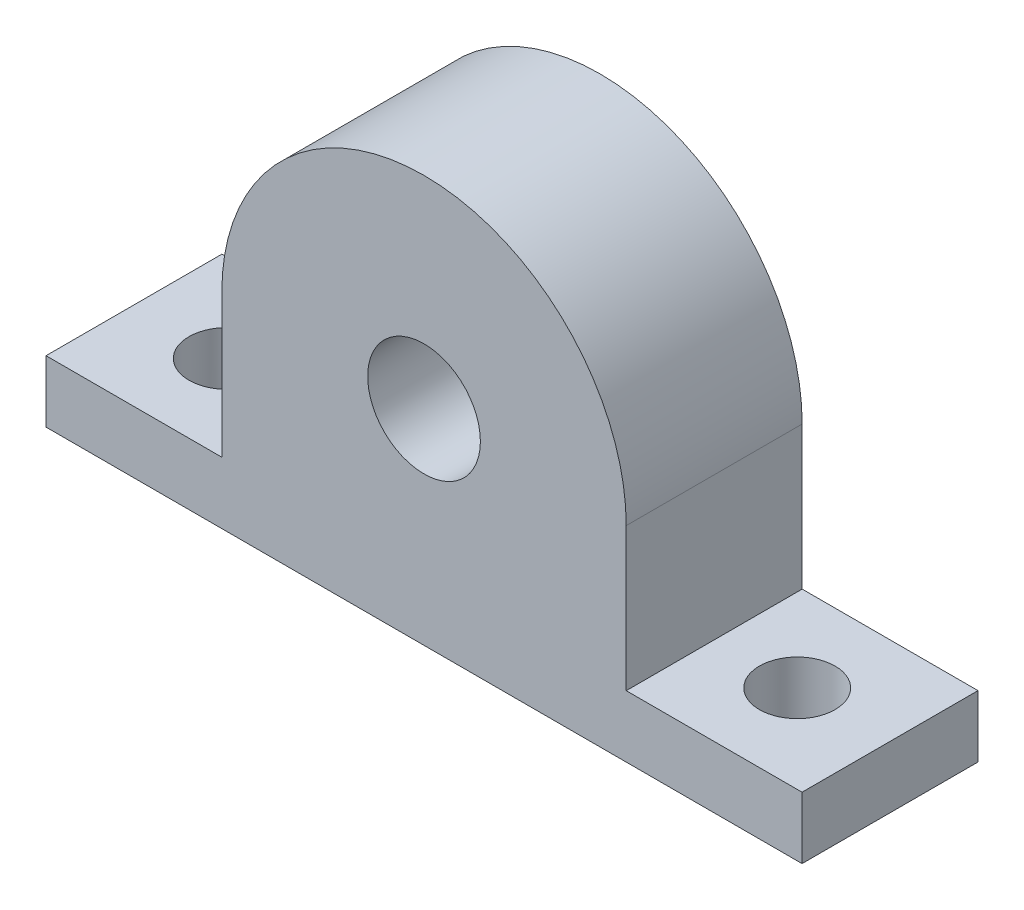
ISO-10303-21;
HEADER;
FILE_DESCRIPTION(('STEP AP214'),'2;1');
FILE_NAME('part.step','',(''),(''),'','','');
FILE_SCHEMA(('AUTOMOTIVE_DESIGN { 1 0 10303 214 1 1 1 1 }'));
ENDSEC;
DATA;
#1=APPLICATION_CONTEXT('core data for automotive mechanical design processes');
#2=APPLICATION_PROTOCOL_DEFINITION('international standard','automotive_design',2000,#1);
#3=PRODUCT_CONTEXT('',#1,'mechanical');
#4=PRODUCT('Part','Part','',(#3));
#5=PRODUCT_RELATED_PRODUCT_CATEGORY('part','',(#4));
#6=PRODUCT_DEFINITION_FORMATION('','',#4);
#7=PRODUCT_DEFINITION_CONTEXT('part definition',#1,'design');
#8=PRODUCT_DEFINITION('design','',#6,#7);
#9=PRODUCT_DEFINITION_SHAPE('','',#8);
#10=(LENGTH_UNIT() NAMED_UNIT(*) SI_UNIT(.MILLI.,.METRE.));
#11=(NAMED_UNIT(*) PLANE_ANGLE_UNIT() SI_UNIT($,.RADIAN.));
#12=(NAMED_UNIT(*) SI_UNIT($,.STERADIAN.) SOLID_ANGLE_UNIT());
#13=UNCERTAINTY_MEASURE_WITH_UNIT(LENGTH_MEASURE(1.E-05),#10,'distance_accuracy_value','');
#14=(GEOMETRIC_REPRESENTATION_CONTEXT(3) GLOBAL_UNCERTAINTY_ASSIGNED_CONTEXT((#13)) GLOBAL_UNIT_ASSIGNED_CONTEXT((#10,
#11,#12)) REPRESENTATION_CONTEXT('',''));
#15=CARTESIAN_POINT('',(0.,0.,0.));
#16=DIRECTION('',(0.,0.,1.));
#17=DIRECTION('',(1.,0.,0.));
#18=AXIS2_PLACEMENT_3D('',#15,#16,#17);
#19=CARTESIAN_POINT('',(0.,0.,12.8));
#20=DIRECTION('',(0.,1.,0.));
#21=DIRECTION('',(0.,0.,1.));
#22=AXIS2_PLACEMENT_3D('',#19,#20,#21);
#23=PLANE('',#22);
#24=CARTESIAN_POINT('',(-20.75,0.,6.4));
#25=DIRECTION('',(0.,-1.,0.));
#26=DIRECTION('',(0.,0.,-1.));
#27=AXIS2_PLACEMENT_3D('',#24,#25,#26);
#28=CIRCLE('',#27,2.75);
#29=CARTESIAN_POINT('',(-20.75,0.,3.65));
#30=VERTEX_POINT('',#29);
#31=EDGE_CURVE('E169',#30,#30,#28,.T.);
#32=ORIENTED_EDGE('',*,*,#31,.F.);
#33=EDGE_LOOP('',(#32));
#34=FACE_BOUND('',#33,.T.);
#35=CARTESIAN_POINT('',(20.75,0.,6.4));
#36=DIRECTION('',(0.,-1.,0.));
#37=DIRECTION('',(0.,0.,-1.));
#38=AXIS2_PLACEMENT_3D('',#35,#36,#37);
#39=CIRCLE('',#38,2.75);
#40=CARTESIAN_POINT('',(20.75,0.,3.65));
#41=VERTEX_POINT('',#40);
#42=EDGE_CURVE('E174',#41,#41,#39,.T.);
#43=ORIENTED_EDGE('',*,*,#42,.F.);
#44=EDGE_LOOP('',(#43));
#45=FACE_BOUND('',#44,.T.);
#46=DIRECTION('',(1.,0.,0.));
#47=VECTOR('',#46,1.);
#48=CARTESIAN_POINT('',(0.,0.,0.));
#49=LINE('',#48,#47);
#50=CARTESIAN_POINT('',(-27.5,0.,0.));
#51=VERTEX_POINT('',#50);
#52=CARTESIAN_POINT('',(27.5,0.,0.));
#53=VERTEX_POINT('',#52);
#54=EDGE_CURVE('E137',#51,#53,#49,.T.);
#55=ORIENTED_EDGE('',*,*,#54,.T.);
#56=DIRECTION('',(0.,0.,-1.));
#57=VECTOR('',#56,1.);
#58=CARTESIAN_POINT('',(27.5,0.,12.8));
#59=LINE('',#58,#57);
#60=CARTESIAN_POINT('',(27.5,0.,12.8));
#61=VERTEX_POINT('',#60);
#62=EDGE_CURVE('E11',#61,#53,#59,.T.);
#63=ORIENTED_EDGE('',*,*,#62,.F.);
#64=DIRECTION('',(1.,0.,0.));
#65=VECTOR('',#64,1.);
#66=CARTESIAN_POINT('',(0.,0.,12.8));
#67=LINE('',#66,#65);
#68=CARTESIAN_POINT('',(-27.5,0.,12.8));
#69=VERTEX_POINT('',#68);
#70=EDGE_CURVE('E158',#69,#61,#67,.T.);
#71=ORIENTED_EDGE('',*,*,#70,.F.);
#72=DIRECTION('',(0.,0.,-1.));
#73=VECTOR('',#72,1.);
#74=CARTESIAN_POINT('',(-27.5,0.,12.8));
#75=LINE('',#74,#73);
#76=EDGE_CURVE('E51',#69,#51,#75,.T.);
#77=ORIENTED_EDGE('',*,*,#76,.T.);
#78=EDGE_LOOP('',(#55,#63,#71,#77));
#79=FACE_BOUND('',#78,.T.);
#80=ADVANCED_FACE('F33',(#34,#45,#79),#23,.F.);
#81=CARTESIAN_POINT('',(27.5,0.,12.8));
#82=DIRECTION('',(-1.,0.,0.));
#83=DIRECTION('',(0.,-1.,0.));
#84=AXIS2_PLACEMENT_3D('',#81,#82,#83);
#85=PLANE('',#84);
#86=DIRECTION('',(0.,1.,0.));
#87=VECTOR('',#86,1.);
#88=CARTESIAN_POINT('',(27.5,0.,0.));
#89=LINE('',#88,#87);
#90=CARTESIAN_POINT('',(27.5,4.50000000000001,0.));
#91=VERTEX_POINT('',#90);
#92=EDGE_CURVE('E139',#53,#91,#89,.T.);
#93=ORIENTED_EDGE('',*,*,#92,.T.);
#94=DIRECTION('',(0.,0.,-1.));
#95=VECTOR('',#94,1.);
#96=CARTESIAN_POINT('',(27.5,4.50000000000001,12.8));
#97=LINE('',#96,#95);
#98=CARTESIAN_POINT('',(27.5,4.50000000000001,12.8));
#99=VERTEX_POINT('',#98);
#100=EDGE_CURVE('E42',#99,#91,#97,.T.);
#101=ORIENTED_EDGE('',*,*,#100,.F.);
#102=DIRECTION('',(0.,1.,0.));
#103=VECTOR('',#102,1.);
#104=CARTESIAN_POINT('',(27.5,0.,12.8));
#105=LINE('',#104,#103);
#106=EDGE_CURVE('E89',#61,#99,#105,.T.);
#107=ORIENTED_EDGE('',*,*,#106,.F.);
#108=ORIENTED_EDGE('',*,*,#62,.T.);
#109=EDGE_LOOP('',(#93,#101,#107,#108));
#110=FACE_BOUND('',#109,.T.);
#111=ADVANCED_FACE('F210',(#110),#85,.F.);
#112=CARTESIAN_POINT('',(0.,4.49999999999999,12.8));
#113=DIRECTION('',(0.,-1.,0.));
#114=DIRECTION('',(1.,0.,0.));
#115=AXIS2_PLACEMENT_3D('',#112,#113,#114);
#116=PLANE('',#115);
#117=CARTESIAN_POINT('',(20.75,4.5,6.4));
#118=DIRECTION('',(0.,-1.,0.));
#119=DIRECTION('',(1.,0.,0.));
#120=AXIS2_PLACEMENT_3D('',#117,#118,#119);
#121=CIRCLE('',#120,2.75);
#122=CARTESIAN_POINT('',(23.5,4.50000000000001,6.4));
#123=VERTEX_POINT('',#122);
#124=EDGE_CURVE('E36',#123,#123,#121,.T.);
#125=ORIENTED_EDGE('',*,*,#124,.T.);
#126=EDGE_LOOP('',(#125));
#127=FACE_BOUND('',#126,.T.);
#128=DIRECTION('',(-1.,0.,0.));
#129=VECTOR('',#128,1.);
#130=CARTESIAN_POINT('',(0.,4.49999999999999,0.));
#131=LINE('',#130,#129);
#132=CARTESIAN_POINT('',(14.709218922619,4.5,0.));
#133=VERTEX_POINT('',#132);
#134=EDGE_CURVE('E141',#91,#133,#131,.T.);
#135=ORIENTED_EDGE('',*,*,#134,.T.);
#136=DIRECTION('',(0.,0.,-1.));
#137=VECTOR('',#136,1.);
#138=CARTESIAN_POINT('',(14.709218922619,4.5,12.8));
#139=LINE('',#138,#137);
#140=CARTESIAN_POINT('',(14.709218922619,4.5,12.8));
#141=VERTEX_POINT('',#140);
#142=EDGE_CURVE('E164',#141,#133,#139,.T.);
#143=ORIENTED_EDGE('',*,*,#142,.F.);
#144=DIRECTION('',(-1.,0.,0.));
#145=VECTOR('',#144,1.);
#146=CARTESIAN_POINT('',(0.,4.49999999999999,12.8));
#147=LINE('',#146,#145);
#148=EDGE_CURVE('E183',#99,#141,#147,.T.);
#149=ORIENTED_EDGE('',*,*,#148,.F.);
#150=ORIENTED_EDGE('',*,*,#100,.T.);
#151=EDGE_LOOP('',(#135,#143,#149,#150));
#152=FACE_BOUND('',#151,.T.);
#153=ADVANCED_FACE('F193',(#127,#152),#116,.F.);
#154=CARTESIAN_POINT('',(14.709218922619,0.,12.8));
#155=DIRECTION('',(1.,0.,0.));
#156=DIRECTION('',(0.,0.,-1.));
#157=AXIS2_PLACEMENT_3D('',#154,#155,#156);
#158=PLANE('',#157);
#159=DIRECTION('',(0.,-1.,0.));
#160=VECTOR('',#159,1.);
#161=CARTESIAN_POINT('',(14.709218922619,0.,0.));
#162=LINE('',#161,#160);
#163=CARTESIAN_POINT('',(14.709218922619,14.9,0.));
#164=VERTEX_POINT('',#163);
#165=EDGE_CURVE('E144',#164,#133,#162,.T.);
#166=ORIENTED_EDGE('',*,*,#165,.F.);
#167=DIRECTION('',(0.,0.,-1.));
#168=VECTOR('',#167,1.);
#169=CARTESIAN_POINT('',(14.709218922619,14.9,12.8));
#170=LINE('',#169,#168);
#171=CARTESIAN_POINT('',(14.709218922619,14.9,12.8));
#172=VERTEX_POINT('',#171);
#173=EDGE_CURVE('E162',#172,#164,#170,.T.);
#174=ORIENTED_EDGE('',*,*,#173,.F.);
#175=DIRECTION('',(0.,-1.,0.));
#176=VECTOR('',#175,1.);
#177=CARTESIAN_POINT('',(14.709218922619,0.,12.8));
#178=LINE('',#177,#176);
#179=EDGE_CURVE('E185',#172,#141,#178,.T.);
#180=ORIENTED_EDGE('',*,*,#179,.T.);
#181=ORIENTED_EDGE('',*,*,#142,.T.);
#182=EDGE_LOOP('',(#166,#174,#180,#181));
#183=FACE_BOUND('',#182,.T.);
#184=ADVANCED_FACE('F189',(#183),#158,.T.);
#185=CARTESIAN_POINT('',(0.,14.9,12.8));
#186=DIRECTION('',(0.,0.,-1.));
#187=DIRECTION('',(-1.,0.,0.));
#188=AXIS2_PLACEMENT_3D('',#185,#186,#187);
#189=CYLINDRICAL_SURFACE('',#188,14.709218922619);
#190=CARTESIAN_POINT('',(0.,14.9,0.));
#191=DIRECTION('',(0.,0.,1.));
#192=DIRECTION('',(1.,0.,0.));
#193=AXIS2_PLACEMENT_3D('',#190,#191,#192);
#194=CIRCLE('',#193,14.709218922619);
#195=CARTESIAN_POINT('',(-14.709218922619,14.9,0.));
#196=VERTEX_POINT('',#195);
#197=EDGE_CURVE('E147',#164,#196,#194,.T.);
#198=ORIENTED_EDGE('',*,*,#197,.T.);
#199=DIRECTION('',(0.,0.,-1.));
#200=VECTOR('',#199,1.);
#201=CARTESIAN_POINT('',(-14.709218922619,14.9,12.8));
#202=LINE('',#201,#200);
#203=CARTESIAN_POINT('',(-14.709218922619,14.9,12.8));
#204=VERTEX_POINT('',#203);
#205=EDGE_CURVE('E126',#204,#196,#202,.T.);
#206=ORIENTED_EDGE('',*,*,#205,.F.);
#207=CARTESIAN_POINT('',(0.,14.9,12.8));
#208=DIRECTION('',(0.,0.,1.));
#209=DIRECTION('',(1.,0.,0.));
#210=AXIS2_PLACEMENT_3D('',#207,#208,#209);
#211=CIRCLE('',#210,14.709218922619);
#212=EDGE_CURVE('E114',#172,#204,#211,.T.);
#213=ORIENTED_EDGE('',*,*,#212,.F.);
#214=ORIENTED_EDGE('',*,*,#173,.T.);
#215=EDGE_LOOP('',(#198,#206,#213,#214));
#216=FACE_BOUND('',#215,.T.);
#217=ADVANCED_FACE('F200',(#216),#189,.T.);
#218=CARTESIAN_POINT('',(-14.709218922619,0.,12.8));
#219=DIRECTION('',(1.,0.,0.));
#220=DIRECTION('',(0.,0.,-1.));
#221=AXIS2_PLACEMENT_3D('',#218,#219,#220);
#222=PLANE('',#221);
#223=DIRECTION('',(0.,-1.,0.));
#224=VECTOR('',#223,1.);
#225=CARTESIAN_POINT('',(-14.709218922619,0.,0.));
#226=LINE('',#225,#224);
#227=CARTESIAN_POINT('',(-14.709218922619,4.5,0.));
#228=VERTEX_POINT('',#227);
#229=EDGE_CURVE('E123',#196,#228,#226,.T.);
#230=ORIENTED_EDGE('',*,*,#229,.T.);
#231=DIRECTION('',(0.,0.,-1.));
#232=VECTOR('',#231,1.);
#233=CARTESIAN_POINT('',(-14.709218922619,4.5,12.8));
#234=LINE('',#233,#232);
#235=CARTESIAN_POINT('',(-14.709218922619,4.5,12.8));
#236=VERTEX_POINT('',#235);
#237=EDGE_CURVE('E120',#236,#228,#234,.T.);
#238=ORIENTED_EDGE('',*,*,#237,.F.);
#239=DIRECTION('',(0.,-1.,0.));
#240=VECTOR('',#239,1.);
#241=CARTESIAN_POINT('',(-14.709218922619,0.,12.8));
#242=LINE('',#241,#240);
#243=EDGE_CURVE('E105',#204,#236,#242,.T.);
#244=ORIENTED_EDGE('',*,*,#243,.F.);
#245=ORIENTED_EDGE('',*,*,#205,.T.);
#246=EDGE_LOOP('',(#230,#238,#244,#245));
#247=FACE_BOUND('',#246,.T.);
#248=ADVANCED_FACE('F121',(#247),#222,.F.);
#249=CARTESIAN_POINT('',(0.,4.5,12.8));
#250=DIRECTION('',(0.,1.,0.));
#251=DIRECTION('',(0.,0.,1.));
#252=AXIS2_PLACEMENT_3D('',#249,#250,#251);
#253=PLANE('',#252);
#254=CARTESIAN_POINT('',(-20.75,4.5,6.4));
#255=DIRECTION('',(0.,1.,0.));
#256=DIRECTION('',(0.,0.,1.));
#257=AXIS2_PLACEMENT_3D('',#254,#255,#256);
#258=CIRCLE('',#257,2.75);
#259=CARTESIAN_POINT('',(-20.75,4.5,9.15));
#260=VERTEX_POINT('',#259);
#261=EDGE_CURVE('E167',#260,#260,#258,.T.);
#262=ORIENTED_EDGE('',*,*,#261,.F.);
#263=EDGE_LOOP('',(#262));
#264=FACE_BOUND('',#263,.T.);
#265=DIRECTION('',(1.,0.,0.));
#266=VECTOR('',#265,1.);
#267=CARTESIAN_POINT('',(0.,4.5,0.));
#268=LINE('',#267,#266);
#269=CARTESIAN_POINT('',(-27.5,4.5,0.));
#270=VERTEX_POINT('',#269);
#271=EDGE_CURVE('E150',#270,#228,#268,.T.);
#272=ORIENTED_EDGE('',*,*,#271,.F.);
#273=DIRECTION('',(0.,0.,-1.));
#274=VECTOR('',#273,1.);
#275=CARTESIAN_POINT('',(-27.5,4.5,12.8));
#276=LINE('',#275,#274);
#277=CARTESIAN_POINT('',(-27.5,4.5,12.8));
#278=VERTEX_POINT('',#277);
#279=EDGE_CURVE('E77',#278,#270,#276,.T.);
#280=ORIENTED_EDGE('',*,*,#279,.F.);
#281=DIRECTION('',(1.,0.,0.));
#282=VECTOR('',#281,1.);
#283=CARTESIAN_POINT('',(0.,4.5,12.8));
#284=LINE('',#283,#282);
#285=EDGE_CURVE('E111',#278,#236,#284,.T.);
#286=ORIENTED_EDGE('',*,*,#285,.T.);
#287=ORIENTED_EDGE('',*,*,#237,.T.);
#288=EDGE_LOOP('',(#272,#280,#286,#287));
#289=FACE_BOUND('',#288,.T.);
#290=ADVANCED_FACE('F128',(#264,#289),#253,.T.);
#291=CARTESIAN_POINT('',(-27.5,0.,12.8));
#292=DIRECTION('',(-1.,0.,0.));
#293=DIRECTION('',(0.,-1.,0.));
#294=AXIS2_PLACEMENT_3D('',#291,#292,#293);
#295=PLANE('',#294);
#296=DIRECTION('',(0.,1.,0.));
#297=VECTOR('',#296,1.);
#298=CARTESIAN_POINT('',(-27.5,0.,0.));
#299=LINE('',#298,#297);
#300=EDGE_CURVE('E152',#51,#270,#299,.T.);
#301=ORIENTED_EDGE('',*,*,#300,.F.);
#302=ORIENTED_EDGE('',*,*,#76,.F.);
#303=DIRECTION('',(0.,1.,0.));
#304=VECTOR('',#303,1.);
#305=CARTESIAN_POINT('',(-27.5,0.,12.8));
#306=LINE('',#305,#304);
#307=EDGE_CURVE('E129',#69,#278,#306,.T.);
#308=ORIENTED_EDGE('',*,*,#307,.T.);
#309=ORIENTED_EDGE('',*,*,#279,.T.);
#310=EDGE_LOOP('',(#301,#302,#308,#309));
#311=FACE_BOUND('',#310,.T.);
#312=ADVANCED_FACE('F218',(#311),#295,.T.);
#313=CARTESIAN_POINT('',(0.,14.9,12.8));
#314=DIRECTION('',(0.,0.,-1.));
#315=DIRECTION('',(-1.,0.,0.));
#316=AXIS2_PLACEMENT_3D('',#313,#314,#315);
#317=CYLINDRICAL_SURFACE('',#316,4.1);
#318=CARTESIAN_POINT('',(0.,14.9,12.8));
#319=DIRECTION('',(0.,0.,1.));
#320=DIRECTION('',(1.,0.,0.));
#321=AXIS2_PLACEMENT_3D('',#318,#319,#320);
#322=CIRCLE('',#321,4.1);
#323=CARTESIAN_POINT('',(4.1,14.9,12.8));
#324=VERTEX_POINT('',#323);
#325=EDGE_CURVE('E131',#324,#324,#322,.T.);
#326=ORIENTED_EDGE('',*,*,#325,.T.);
#327=EDGE_LOOP('',(#326));
#328=FACE_BOUND('',#327,.T.);
#329=CARTESIAN_POINT('',(0.,14.9,0.));
#330=DIRECTION('',(0.,0.,1.));
#331=DIRECTION('',(1.,0.,0.));
#332=AXIS2_PLACEMENT_3D('',#329,#330,#331);
#333=CIRCLE('',#332,4.1);
#334=CARTESIAN_POINT('',(4.1,14.9,0.));
#335=VERTEX_POINT('',#334);
#336=EDGE_CURVE('E155',#335,#335,#333,.T.);
#337=ORIENTED_EDGE('',*,*,#336,.F.);
#338=EDGE_LOOP('',(#337));
#339=FACE_BOUND('',#338,.T.);
#340=ADVANCED_FACE('F220',(#328,#339),#317,.F.);
#341=CARTESIAN_POINT('',(0.,0.,12.8));
#342=DIRECTION('',(0.,0.,1.));
#343=DIRECTION('',(1.,0.,0.));
#344=AXIS2_PLACEMENT_3D('',#341,#342,#343);
#345=PLANE('',#344);
#346=ORIENTED_EDGE('',*,*,#70,.T.);
#347=ORIENTED_EDGE('',*,*,#106,.T.);
#348=ORIENTED_EDGE('',*,*,#148,.T.);
#349=ORIENTED_EDGE('',*,*,#179,.F.);
#350=ORIENTED_EDGE('',*,*,#212,.T.);
#351=ORIENTED_EDGE('',*,*,#243,.T.);
#352=ORIENTED_EDGE('',*,*,#285,.F.);
#353=ORIENTED_EDGE('',*,*,#307,.F.);
#354=EDGE_LOOP('',(#346,#347,#348,#349,#350,#351,#352,#353));
#355=FACE_BOUND('',#354,.T.);
#356=ORIENTED_EDGE('',*,*,#325,.F.);
#357=EDGE_LOOP('',(#356));
#358=FACE_BOUND('',#357,.T.);
#359=ADVANCED_FACE('F107',(#355,#358),#345,.T.);
#360=CARTESIAN_POINT('',(0.,0.,0.));
#361=DIRECTION('',(0.,0.,1.));
#362=DIRECTION('',(1.,0.,0.));
#363=AXIS2_PLACEMENT_3D('',#360,#361,#362);
#364=PLANE('',#363);
#365=ORIENTED_EDGE('',*,*,#54,.F.);
#366=ORIENTED_EDGE('',*,*,#300,.T.);
#367=ORIENTED_EDGE('',*,*,#271,.T.);
#368=ORIENTED_EDGE('',*,*,#229,.F.);
#369=ORIENTED_EDGE('',*,*,#197,.F.);
#370=ORIENTED_EDGE('',*,*,#165,.T.);
#371=ORIENTED_EDGE('',*,*,#134,.F.);
#372=ORIENTED_EDGE('',*,*,#92,.F.);
#373=EDGE_LOOP('',(#365,#366,#367,#368,#369,#370,#371,#372));
#374=FACE_BOUND('',#373,.T.);
#375=ORIENTED_EDGE('',*,*,#336,.T.);
#376=EDGE_LOOP('',(#375));
#377=FACE_BOUND('',#376,.T.);
#378=ADVANCED_FACE('F197',(#374,#377),#364,.F.);
#379=CARTESIAN_POINT('',(-20.75,29.609218922619,6.4));
#380=DIRECTION('',(0.,-1.,0.));
#381=DIRECTION('',(0.,0.,-1.));
#382=AXIS2_PLACEMENT_3D('',#379,#380,#381);
#383=CYLINDRICAL_SURFACE('',#382,2.75);
#384=ORIENTED_EDGE('',*,*,#261,.T.);
#385=EDGE_LOOP('',(#384));
#386=FACE_BOUND('',#385,.T.);
#387=ORIENTED_EDGE('',*,*,#31,.T.);
#388=EDGE_LOOP('',(#387));
#389=FACE_BOUND('',#388,.T.);
#390=ADVANCED_FACE('F233',(#386,#389),#383,.F.);
#391=CARTESIAN_POINT('',(20.75,29.609218922619,6.4));
#392=DIRECTION('',(0.,-1.,0.));
#393=DIRECTION('',(0.,0.,-1.));
#394=AXIS2_PLACEMENT_3D('',#391,#392,#393);
#395=CYLINDRICAL_SURFACE('',#394,2.75);
#396=ORIENTED_EDGE('',*,*,#42,.T.);
#397=EDGE_LOOP('',(#396));
#398=FACE_BOUND('',#397,.T.);
#399=ORIENTED_EDGE('',*,*,#124,.F.);
#400=EDGE_LOOP('',(#399));
#401=FACE_BOUND('',#400,.T.);
#402=ADVANCED_FACE('F236',(#398,#401),#395,.F.);
#403=CLOSED_SHELL('',(#80,#111,#153,#184,#217,#248,#290,#312,#340,#359,#378,#390,#402));
#404=MANIFOLD_SOLID_BREP('B2',#403);
#405=ADVANCED_BREP_SHAPE_REPRESENTATION('',(#18,#404),#14);
#406=SHAPE_DEFINITION_REPRESENTATION(#9,#405);
ENDSEC;
END-ISO-10303-21;
